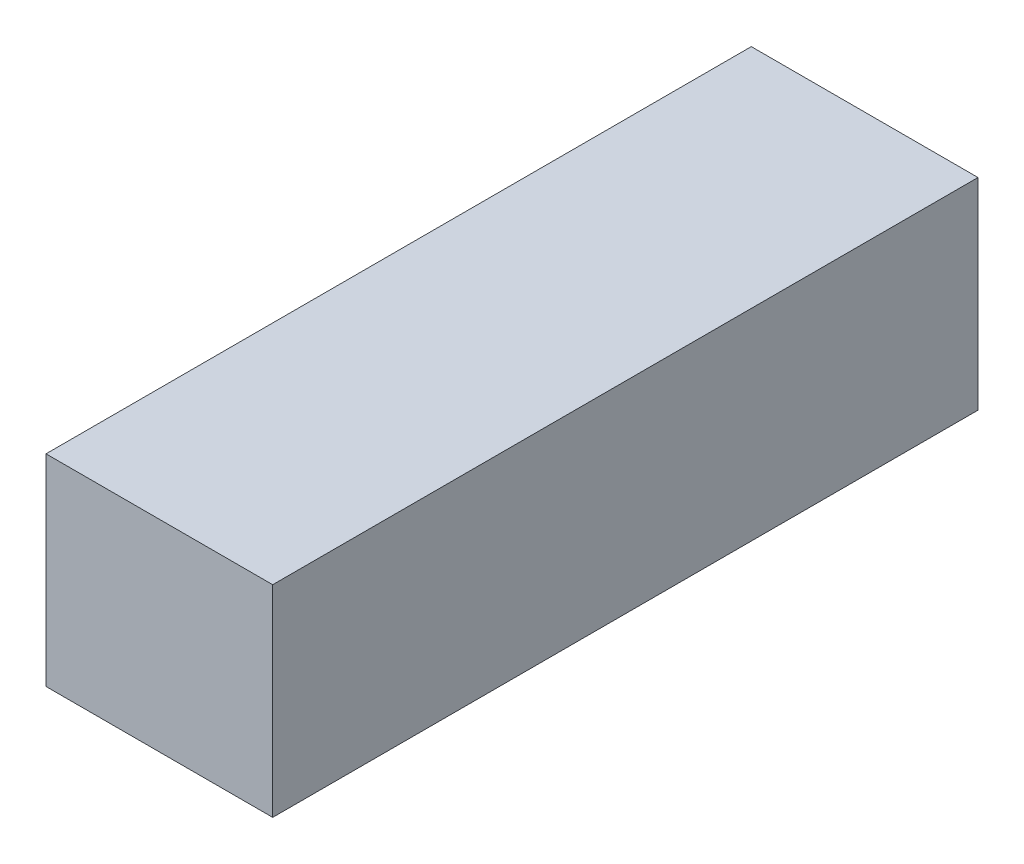
ISO-10303-21;
HEADER;
FILE_DESCRIPTION(('STEP AP214'),'2;1');
FILE_NAME('part.step','',(''),(''),'','','');
FILE_SCHEMA(('AUTOMOTIVE_DESIGN { 1 0 10303 214 1 1 1 1 }'));
ENDSEC;
DATA;
#1=APPLICATION_CONTEXT('core data for automotive mechanical design processes');
#2=APPLICATION_PROTOCOL_DEFINITION('international standard','automotive_design',2000,#1);
#3=PRODUCT_CONTEXT('',#1,'mechanical');
#4=PRODUCT('Part','Part','',(#3));
#5=PRODUCT_RELATED_PRODUCT_CATEGORY('part','',(#4));
#6=PRODUCT_DEFINITION_FORMATION('','',#4);
#7=PRODUCT_DEFINITION_CONTEXT('part definition',#1,'design');
#8=PRODUCT_DEFINITION('design','',#6,#7);
#9=PRODUCT_DEFINITION_SHAPE('','',#8);
#10=(LENGTH_UNIT() NAMED_UNIT(*) SI_UNIT(.MILLI.,.METRE.));
#11=(NAMED_UNIT(*) PLANE_ANGLE_UNIT() SI_UNIT($,.RADIAN.));
#12=(NAMED_UNIT(*) SI_UNIT($,.STERADIAN.) SOLID_ANGLE_UNIT());
#13=UNCERTAINTY_MEASURE_WITH_UNIT(LENGTH_MEASURE(1.E-05),#10,'distance_accuracy_value','');
#14=(GEOMETRIC_REPRESENTATION_CONTEXT(3) GLOBAL_UNCERTAINTY_ASSIGNED_CONTEXT((#13)) GLOBAL_UNIT_ASSIGNED_CONTEXT((#10,
#11,#12)) REPRESENTATION_CONTEXT('',''));
#15=CARTESIAN_POINT('',(0.,0.,0.));
#16=DIRECTION('',(0.,0.,1.));
#17=DIRECTION('',(1.,0.,0.));
#18=AXIS2_PLACEMENT_3D('',#15,#16,#17);
#19=CARTESIAN_POINT('',(2.25,2.,7.));
#20=DIRECTION('',(-1.,0.,0.));
#21=DIRECTION('',(0.,-1.,0.));
#22=AXIS2_PLACEMENT_3D('',#19,#20,#21);
#23=PLANE('',#22);
#24=DIRECTION('',(0.,1.,0.));
#25=VECTOR('',#24,1.);
#26=CARTESIAN_POINT('',(2.25,2.,-7.));
#27=LINE('',#26,#25);
#28=CARTESIAN_POINT('',(2.25,-2.,-7.));
#29=VERTEX_POINT('',#28);
#30=CARTESIAN_POINT('',(2.25,2.,-7.));
#31=VERTEX_POINT('',#30);
#32=EDGE_CURVE('E100',#29,#31,#27,.T.);
#33=ORIENTED_EDGE('',*,*,#32,.T.);
#34=DIRECTION('',(0.,0.,-1.));
#35=VECTOR('',#34,1.);
#36=CARTESIAN_POINT('',(2.25,2.,7.));
#37=LINE('',#36,#35);
#38=CARTESIAN_POINT('',(2.25,2.,7.));
#39=VERTEX_POINT('',#38);
#40=EDGE_CURVE('E11',#39,#31,#37,.T.);
#41=ORIENTED_EDGE('',*,*,#40,.F.);
#42=DIRECTION('',(0.,1.,0.));
#43=VECTOR('',#42,1.);
#44=CARTESIAN_POINT('',(2.25,2.,7.));
#45=LINE('',#44,#43);
#46=CARTESIAN_POINT('',(2.25,-2.,7.));
#47=VERTEX_POINT('',#46);
#48=EDGE_CURVE('E88',#47,#39,#45,.T.);
#49=ORIENTED_EDGE('',*,*,#48,.F.);
#50=DIRECTION('',(0.,0.,-1.));
#51=VECTOR('',#50,1.);
#52=CARTESIAN_POINT('',(2.25,-2.,7.));
#53=LINE('',#52,#51);
#54=EDGE_CURVE('E96',#47,#29,#53,.T.);
#55=ORIENTED_EDGE('',*,*,#54,.T.);
#56=EDGE_LOOP('',(#33,#41,#49,#55));
#57=FACE_BOUND('',#56,.T.);
#58=ADVANCED_FACE('F37',(#57),#23,.F.);
#59=CARTESIAN_POINT('',(-2.25,2.,7.));
#60=DIRECTION('',(0.,-1.,0.));
#61=DIRECTION('',(0.,0.,-1.));
#62=AXIS2_PLACEMENT_3D('',#59,#60,#61);
#63=PLANE('',#62);
#64=DIRECTION('',(-1.,0.,0.));
#65=VECTOR('',#64,1.);
#66=CARTESIAN_POINT('',(-2.25,2.,-7.));
#67=LINE('',#66,#65);
#68=CARTESIAN_POINT('',(-2.25,2.,-7.));
#69=VERTEX_POINT('',#68);
#70=EDGE_CURVE('E92',#31,#69,#67,.T.);
#71=ORIENTED_EDGE('',*,*,#70,.T.);
#72=DIRECTION('',(0.,0.,-1.));
#73=VECTOR('',#72,1.);
#74=CARTESIAN_POINT('',(-2.25,2.,7.));
#75=LINE('',#74,#73);
#76=CARTESIAN_POINT('',(-2.25,2.,7.));
#77=VERTEX_POINT('',#76);
#78=EDGE_CURVE('E45',#77,#69,#75,.T.);
#79=ORIENTED_EDGE('',*,*,#78,.F.);
#80=DIRECTION('',(-1.,0.,0.));
#81=VECTOR('',#80,1.);
#82=CARTESIAN_POINT('',(-2.25,2.,7.));
#83=LINE('',#82,#81);
#84=EDGE_CURVE('E83',#39,#77,#83,.T.);
#85=ORIENTED_EDGE('',*,*,#84,.F.);
#86=ORIENTED_EDGE('',*,*,#40,.T.);
#87=EDGE_LOOP('',(#71,#79,#85,#86));
#88=FACE_BOUND('',#87,.T.);
#89=ADVANCED_FACE('F91',(#88),#63,.F.);
#90=CARTESIAN_POINT('',(-2.25,2.,7.));
#91=DIRECTION('',(1.,0.,0.));
#92=DIRECTION('',(0.,1.,0.));
#93=AXIS2_PLACEMENT_3D('',#90,#91,#92);
#94=PLANE('',#93);
#95=DIRECTION('',(0.,-1.,0.));
#96=VECTOR('',#95,1.);
#97=CARTESIAN_POINT('',(-2.25,2.,-7.));
#98=LINE('',#97,#96);
#99=CARTESIAN_POINT('',(-2.25,-2.,-7.));
#100=VERTEX_POINT('',#99);
#101=EDGE_CURVE('E70',#69,#100,#98,.T.);
#102=ORIENTED_EDGE('',*,*,#101,.T.);
#103=DIRECTION('',(0.,0.,-1.));
#104=VECTOR('',#103,1.);
#105=CARTESIAN_POINT('',(-2.25,-2.,7.));
#106=LINE('',#105,#104);
#107=CARTESIAN_POINT('',(-2.25,-2.,7.));
#108=VERTEX_POINT('',#107);
#109=EDGE_CURVE('E93',#108,#100,#106,.T.);
#110=ORIENTED_EDGE('',*,*,#109,.F.);
#111=DIRECTION('',(0.,-1.,0.));
#112=VECTOR('',#111,1.);
#113=CARTESIAN_POINT('',(-2.25,2.,7.));
#114=LINE('',#113,#112);
#115=EDGE_CURVE('E86',#77,#108,#114,.T.);
#116=ORIENTED_EDGE('',*,*,#115,.F.);
#117=ORIENTED_EDGE('',*,*,#78,.T.);
#118=EDGE_LOOP('',(#102,#110,#116,#117));
#119=FACE_BOUND('',#118,.T.);
#120=ADVANCED_FACE('F94',(#119),#94,.F.);
#121=CARTESIAN_POINT('',(-2.25,-2.,7.));
#122=DIRECTION('',(0.,1.,0.));
#123=DIRECTION('',(0.,0.,1.));
#124=AXIS2_PLACEMENT_3D('',#121,#122,#123);
#125=PLANE('',#124);
#126=DIRECTION('',(1.,0.,0.));
#127=VECTOR('',#126,1.);
#128=CARTESIAN_POINT('',(-2.25,-2.,-7.));
#129=LINE('',#128,#127);
#130=EDGE_CURVE('E76',#100,#29,#129,.T.);
#131=ORIENTED_EDGE('',*,*,#130,.T.);
#132=ORIENTED_EDGE('',*,*,#54,.F.);
#133=DIRECTION('',(1.,0.,0.));
#134=VECTOR('',#133,1.);
#135=CARTESIAN_POINT('',(-2.25,-2.,7.));
#136=LINE('',#135,#134);
#137=EDGE_CURVE('E53',#108,#47,#136,.T.);
#138=ORIENTED_EDGE('',*,*,#137,.F.);
#139=ORIENTED_EDGE('',*,*,#109,.T.);
#140=EDGE_LOOP('',(#131,#132,#138,#139));
#141=FACE_BOUND('',#140,.T.);
#142=ADVANCED_FACE('F107',(#141),#125,.F.);
#143=CARTESIAN_POINT('',(0.,0.,7.));
#144=DIRECTION('',(0.,0.,1.));
#145=DIRECTION('',(1.,0.,0.));
#146=AXIS2_PLACEMENT_3D('',#143,#144,#145);
#147=PLANE('',#146);
#148=ORIENTED_EDGE('',*,*,#48,.T.);
#149=ORIENTED_EDGE('',*,*,#84,.T.);
#150=ORIENTED_EDGE('',*,*,#115,.T.);
#151=ORIENTED_EDGE('',*,*,#137,.T.);
#152=EDGE_LOOP('',(#148,#149,#150,#151));
#153=FACE_BOUND('',#152,.T.);
#154=ADVANCED_FACE('F84',(#153),#147,.T.);
#155=CARTESIAN_POINT('',(0.,0.,-7.));
#156=DIRECTION('',(0.,0.,1.));
#157=DIRECTION('',(1.,0.,0.));
#158=AXIS2_PLACEMENT_3D('',#155,#156,#157);
#159=PLANE('',#158);
#160=ORIENTED_EDGE('',*,*,#32,.F.);
#161=ORIENTED_EDGE('',*,*,#130,.F.);
#162=ORIENTED_EDGE('',*,*,#101,.F.);
#163=ORIENTED_EDGE('',*,*,#70,.F.);
#164=EDGE_LOOP('',(#160,#161,#162,#163));
#165=FACE_BOUND('',#164,.T.);
#166=ADVANCED_FACE('F110',(#165),#159,.F.);
#167=CLOSED_SHELL('',(#58,#89,#120,#142,#154,#166));
#168=MANIFOLD_SOLID_BREP('B2',#167);
#169=ADVANCED_BREP_SHAPE_REPRESENTATION('',(#18,#168),#14);
#170=SHAPE_DEFINITION_REPRESENTATION(#9,#169);
ENDSEC;
END-ISO-10303-21;
